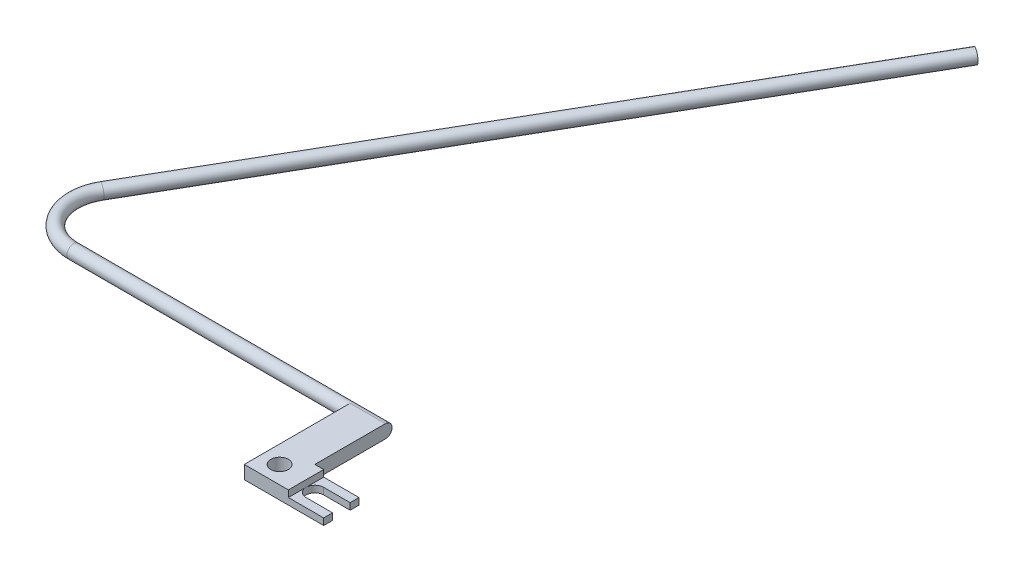
ISO-10303-21;
HEADER;
FILE_DESCRIPTION(('STEP AP214'),'2;1');
FILE_NAME('part.step','',(''),(''),'','','');
FILE_SCHEMA(('AUTOMOTIVE_DESIGN { 1 0 10303 214 1 1 1 1 }'));
ENDSEC;
DATA;
#1=APPLICATION_CONTEXT('core data for automotive mechanical design processes');
#2=APPLICATION_PROTOCOL_DEFINITION('international standard','automotive_design',2000,#1);
#3=PRODUCT_CONTEXT('',#1,'mechanical');
#4=PRODUCT('Part','Part','',(#3));
#5=PRODUCT_RELATED_PRODUCT_CATEGORY('part','',(#4));
#6=PRODUCT_DEFINITION_FORMATION('','',#4);
#7=PRODUCT_DEFINITION_CONTEXT('part definition',#1,'design');
#8=PRODUCT_DEFINITION('design','',#6,#7);
#9=PRODUCT_DEFINITION_SHAPE('','',#8);
#10=(LENGTH_UNIT() NAMED_UNIT(*) SI_UNIT(.MILLI.,.METRE.));
#11=(NAMED_UNIT(*) PLANE_ANGLE_UNIT() SI_UNIT($,.RADIAN.));
#12=(NAMED_UNIT(*) SI_UNIT($,.STERADIAN.) SOLID_ANGLE_UNIT());
#13=UNCERTAINTY_MEASURE_WITH_UNIT(LENGTH_MEASURE(1.E-05),#10,'distance_accuracy_value','');
#14=(GEOMETRIC_REPRESENTATION_CONTEXT(3) GLOBAL_UNCERTAINTY_ASSIGNED_CONTEXT((#13)) GLOBAL_UNIT_ASSIGNED_CONTEXT((#10,
#11,#12)) REPRESENTATION_CONTEXT('',''));
#15=CARTESIAN_POINT('',(0.,0.,0.));
#16=DIRECTION('',(0.,0.,1.));
#17=DIRECTION('',(1.,0.,0.));
#18=AXIS2_PLACEMENT_3D('',#15,#16,#17);
#19=CARTESIAN_POINT('',(3.99999999999999,3.,4.));
#20=DIRECTION('',(0.,1.,0.));
#21=DIRECTION('',(0.,0.,1.));
#22=AXIS2_PLACEMENT_3D('',#19,#20,#21);
#23=PLANE('',#22);
#24=DIRECTION('',(-1.,0.,0.));
#25=VECTOR('',#24,1.);
#26=CARTESIAN_POINT('',(2.,3.,-15.9963911959244));
#27=LINE('',#26,#25);
#28=CARTESIAN_POINT('',(0.,3.,-15.9963911959244));
#29=VERTEX_POINT('',#28);
#30=CARTESIAN_POINT('',(-8.,3.,-15.9963911959244));
#31=VERTEX_POINT('',#30);
#32=EDGE_CURVE('E127',#29,#31,#27,.T.);
#33=ORIENTED_EDGE('',*,*,#32,.T.);
#34=DIRECTION('',(0.,0.,1.));
#35=VECTOR('',#34,1.);
#36=CARTESIAN_POINT('',(-8.,3.,-20.));
#37=LINE('',#36,#35);
#38=CARTESIAN_POINT('',(-7.99999999999999,3.,8.));
#39=VERTEX_POINT('',#38);
#40=EDGE_CURVE('E131',#31,#39,#37,.T.);
#41=ORIENTED_EDGE('',*,*,#40,.T.);
#42=DIRECTION('',(1.,0.,0.));
#43=VECTOR('',#42,1.);
#44=CARTESIAN_POINT('',(-7.99999999999999,3.,8.));
#45=LINE('',#44,#43);
#46=CARTESIAN_POINT('',(2.,3.,8.));
#47=VERTEX_POINT('',#46);
#48=EDGE_CURVE('E141',#39,#47,#45,.T.);
#49=ORIENTED_EDGE('',*,*,#48,.T.);
#50=DIRECTION('',(0.,0.,-1.));
#51=VECTOR('',#50,1.);
#52=CARTESIAN_POINT('',(2.,3.,10.));
#53=LINE('',#52,#51);
#54=CARTESIAN_POINT('',(2.,3.,0.));
#55=VERTEX_POINT('',#54);
#56=EDGE_CURVE('E241',#47,#55,#53,.T.);
#57=ORIENTED_EDGE('',*,*,#56,.T.);
#58=DIRECTION('',(-1.,0.,0.));
#59=VECTOR('',#58,1.);
#60=CARTESIAN_POINT('',(10.,3.,0.));
#61=LINE('',#60,#59);
#62=CARTESIAN_POINT('',(0.,3.,0.));
#63=VERTEX_POINT('',#62);
#64=EDGE_CURVE('E168',#55,#63,#61,.T.);
#65=ORIENTED_EDGE('',*,*,#64,.T.);
#66=DIRECTION('',(0.,0.,-1.));
#67=VECTOR('',#66,1.);
#68=CARTESIAN_POINT('',(0.,3.,0.));
#69=LINE('',#68,#67);
#70=EDGE_CURVE('E134',#63,#29,#69,.T.);
#71=ORIENTED_EDGE('',*,*,#70,.T.);
#72=EDGE_LOOP('',(#33,#41,#49,#57,#65,#71));
#73=FACE_BOUND('',#72,.T.);
#74=CARTESIAN_POINT('',(-4.,3.,4.));
#75=DIRECTION('',(0.,1.,0.));
#76=DIRECTION('',(0.,0.,1.));
#77=AXIS2_PLACEMENT_3D('',#74,#75,#76);
#78=CIRCLE('',#77,2.);
#79=CARTESIAN_POINT('',(-4.,3.,6.));
#80=VERTEX_POINT('',#79);
#81=EDGE_CURVE('E161',#80,#80,#78,.T.);
#82=ORIENTED_EDGE('',*,*,#81,.F.);
#83=EDGE_LOOP('',(#82));
#84=FACE_BOUND('',#83,.T.);
#85=ADVANCED_FACE('F34',(#73,#84),#23,.T.);
#86=CARTESIAN_POINT('',(3.99999999999999,0.,4.));
#87=DIRECTION('',(0.,1.,0.));
#88=DIRECTION('',(0.,0.,1.));
#89=AXIS2_PLACEMENT_3D('',#86,#87,#88);
#90=PLANE('',#89);
#91=DIRECTION('',(0.,0.,1.));
#92=VECTOR('',#91,1.);
#93=CARTESIAN_POINT('',(-8.,0.,-20.));
#94=LINE('',#93,#92);
#95=CARTESIAN_POINT('',(-8.,0.,-15.9963911959244));
#96=VERTEX_POINT('',#95);
#97=CARTESIAN_POINT('',(-7.99999999999999,0.,8.));
#98=VERTEX_POINT('',#97);
#99=EDGE_CURVE('E164',#96,#98,#94,.T.);
#100=ORIENTED_EDGE('',*,*,#99,.F.);
#101=DIRECTION('',(-1.,0.,0.));
#102=VECTOR('',#101,1.);
#103=CARTESIAN_POINT('',(2.,0.,-15.9963911959244));
#104=LINE('',#103,#102);
#105=CARTESIAN_POINT('',(0.,0.,-15.9963911959244));
#106=VERTEX_POINT('',#105);
#107=EDGE_CURVE('E57',#106,#96,#104,.T.);
#108=ORIENTED_EDGE('',*,*,#107,.F.);
#109=DIRECTION('',(0.,0.,-1.));
#110=VECTOR('',#109,1.);
#111=CARTESIAN_POINT('',(0.,0.,0.));
#112=LINE('',#111,#110);
#113=CARTESIAN_POINT('',(0.,0.,0.));
#114=VERTEX_POINT('',#113);
#115=EDGE_CURVE('E142',#114,#106,#112,.T.);
#116=ORIENTED_EDGE('',*,*,#115,.F.);
#117=DIRECTION('',(-1.,0.,0.));
#118=VECTOR('',#117,1.);
#119=CARTESIAN_POINT('',(10.,0.,0.));
#120=LINE('',#119,#118);
#121=CARTESIAN_POINT('',(10.,0.,0.));
#122=VERTEX_POINT('',#121);
#123=EDGE_CURVE('E191',#122,#114,#120,.T.);
#124=ORIENTED_EDGE('',*,*,#123,.F.);
#125=DIRECTION('',(0.,0.,-1.));
#126=VECTOR('',#125,1.);
#127=CARTESIAN_POINT('',(10.,0.,2.));
#128=LINE('',#127,#126);
#129=CARTESIAN_POINT('',(10.,0.,2.));
#130=VERTEX_POINT('',#129);
#131=EDGE_CURVE('E188',#130,#122,#128,.T.);
#132=ORIENTED_EDGE('',*,*,#131,.F.);
#133=DIRECTION('',(1.,0.,0.));
#134=VECTOR('',#133,1.);
#135=CARTESIAN_POINT('',(3.99999999999999,0.,2.));
#136=LINE('',#135,#134);
#137=CARTESIAN_POINT('',(3.99999999999999,0.,2.));
#138=VERTEX_POINT('',#137);
#139=EDGE_CURVE('E185',#138,#130,#136,.T.);
#140=ORIENTED_EDGE('',*,*,#139,.F.);
#141=CARTESIAN_POINT('',(3.99999999999999,0.,4.));
#142=DIRECTION('',(0.,-1.,0.));
#143=DIRECTION('',(0.,0.,1.));
#144=AXIS2_PLACEMENT_3D('',#141,#142,#143);
#145=CIRCLE('',#144,2.);
#146=CARTESIAN_POINT('',(3.99999999999999,0.,6.));
#147=VERTEX_POINT('',#146);
#148=EDGE_CURVE('E182',#147,#138,#145,.T.);
#149=ORIENTED_EDGE('',*,*,#148,.F.);
#150=DIRECTION('',(-1.,0.,0.));
#151=VECTOR('',#150,1.);
#152=CARTESIAN_POINT('',(3.99999999999999,0.,6.));
#153=LINE('',#152,#151);
#154=CARTESIAN_POINT('',(10.,0.,6.));
#155=VERTEX_POINT('',#154);
#156=EDGE_CURVE('E179',#155,#147,#153,.T.);
#157=ORIENTED_EDGE('',*,*,#156,.F.);
#158=DIRECTION('',(0.,0.,-1.));
#159=VECTOR('',#158,1.);
#160=CARTESIAN_POINT('',(10.,0.,7.99999999999999));
#161=LINE('',#160,#159);
#162=CARTESIAN_POINT('',(10.,0.,7.99999999999999));
#163=VERTEX_POINT('',#162);
#164=EDGE_CURVE('E176',#163,#155,#161,.T.);
#165=ORIENTED_EDGE('',*,*,#164,.F.);
#166=DIRECTION('',(1.,0.,0.));
#167=VECTOR('',#166,1.);
#168=CARTESIAN_POINT('',(-7.99999999999999,0.,8.));
#169=LINE('',#168,#167);
#170=EDGE_CURVE('E173',#98,#163,#169,.T.);
#171=ORIENTED_EDGE('',*,*,#170,.F.);
#172=EDGE_LOOP('',(#100,#108,#116,#124,#132,#140,#149,#157,#165,#171));
#173=FACE_BOUND('',#172,.T.);
#174=CARTESIAN_POINT('',(-4.,0.,4.));
#175=DIRECTION('',(0.,1.,0.));
#176=DIRECTION('',(0.,0.,1.));
#177=AXIS2_PLACEMENT_3D('',#174,#175,#176);
#178=CIRCLE('',#177,2.);
#179=CARTESIAN_POINT('',(-4.,0.,6.));
#180=VERTEX_POINT('',#179);
#181=EDGE_CURVE('E160',#180,#180,#178,.T.);
#182=ORIENTED_EDGE('',*,*,#181,.T.);
#183=EDGE_LOOP('',(#182));
#184=FACE_BOUND('',#183,.T.);
#185=ADVANCED_FACE('F220',(#173,#184),#90,.F.);
#186=CARTESIAN_POINT('',(-8.,3.,-20.));
#187=DIRECTION('',(1.,0.,0.));
#188=DIRECTION('',(0.,0.,-1.));
#189=AXIS2_PLACEMENT_3D('',#186,#187,#188);
#190=PLANE('',#189);
#191=CARTESIAN_POINT('',(-8.,1.5,-15.9963911959244));
#192=DIRECTION('',(-1.,0.,0.));
#193=DIRECTION('',(0.,0.,1.));
#194=AXIS2_PLACEMENT_3D('',#191,#192,#193);
#195=CIRCLE('',#194,1.5);
#196=EDGE_CURVE('E42',#96,#31,#195,.T.);
#197=ORIENTED_EDGE('',*,*,#196,.F.);
#198=ORIENTED_EDGE('',*,*,#99,.T.);
#199=DIRECTION('',(0.,-1.,0.));
#200=VECTOR('',#199,1.);
#201=CARTESIAN_POINT('',(-7.99999999999999,3.,8.));
#202=LINE('',#201,#200);
#203=EDGE_CURVE('E139',#39,#98,#202,.T.);
#204=ORIENTED_EDGE('',*,*,#203,.F.);
#205=ORIENTED_EDGE('',*,*,#40,.F.);
#206=EDGE_LOOP('',(#197,#198,#204,#205));
#207=FACE_BOUND('',#206,.T.);
#208=ADVANCED_FACE('F36',(#207),#190,.F.);
#209=CARTESIAN_POINT('',(-7.99999999999999,3.,8.));
#210=DIRECTION('',(0.,0.,-1.));
#211=DIRECTION('',(-1.,0.,0.));
#212=AXIS2_PLACEMENT_3D('',#209,#210,#211);
#213=PLANE('',#212);
#214=DIRECTION('',(-1.,0.,0.));
#215=VECTOR('',#214,1.);
#216=CARTESIAN_POINT('',(-7.99999999999999,1.5,8.));
#217=LINE('',#216,#215);
#218=CARTESIAN_POINT('',(10.,1.5,7.99999999999999));
#219=VERTEX_POINT('',#218);
#220=CARTESIAN_POINT('',(2.,1.5,8.));
#221=VERTEX_POINT('',#220);
#222=EDGE_CURVE('E231',#219,#221,#217,.T.);
#223=ORIENTED_EDGE('',*,*,#222,.T.);
#224=DIRECTION('',(0.,1.,0.));
#225=VECTOR('',#224,1.);
#226=CARTESIAN_POINT('',(2.,3.,8.));
#227=LINE('',#226,#225);
#228=EDGE_CURVE('E149',#221,#47,#227,.T.);
#229=ORIENTED_EDGE('',*,*,#228,.T.);
#230=ORIENTED_EDGE('',*,*,#48,.F.);
#231=ORIENTED_EDGE('',*,*,#203,.T.);
#232=ORIENTED_EDGE('',*,*,#170,.T.);
#233=DIRECTION('',(0.,-1.,0.));
#234=VECTOR('',#233,1.);
#235=CARTESIAN_POINT('',(10.,3.,7.99999999999999));
#236=LINE('',#235,#234);
#237=EDGE_CURVE('E146',#219,#163,#236,.T.);
#238=ORIENTED_EDGE('',*,*,#237,.F.);
#239=EDGE_LOOP('',(#223,#229,#230,#231,#232,#238));
#240=FACE_BOUND('',#239,.T.);
#241=ADVANCED_FACE('F218',(#240),#213,.F.);
#242=CARTESIAN_POINT('',(10.,3.,7.99999999999999));
#243=DIRECTION('',(-1.,0.,0.));
#244=DIRECTION('',(0.,0.,1.));
#245=AXIS2_PLACEMENT_3D('',#242,#243,#244);
#246=PLANE('',#245);
#247=DIRECTION('',(0.,-1.,0.));
#248=VECTOR('',#247,1.);
#249=CARTESIAN_POINT('',(10.,3.,6.));
#250=LINE('',#249,#248);
#251=CARTESIAN_POINT('',(10.,1.5,6.));
#252=VERTEX_POINT('',#251);
#253=EDGE_CURVE('E205',#252,#155,#250,.T.);
#254=ORIENTED_EDGE('',*,*,#253,.F.);
#255=DIRECTION('',(0.,0.,-1.));
#256=VECTOR('',#255,1.);
#257=CARTESIAN_POINT('',(10.,1.5,10.));
#258=LINE('',#257,#256);
#259=EDGE_CURVE('E214',#219,#252,#258,.T.);
#260=ORIENTED_EDGE('',*,*,#259,.F.);
#261=ORIENTED_EDGE('',*,*,#237,.T.);
#262=ORIENTED_EDGE('',*,*,#164,.T.);
#263=EDGE_LOOP('',(#254,#260,#261,#262));
#264=FACE_BOUND('',#263,.T.);
#265=ADVANCED_FACE('F211',(#264),#246,.F.);
#266=CARTESIAN_POINT('',(3.99999999999999,3.,6.));
#267=DIRECTION('',(0.,0.,1.));
#268=DIRECTION('',(1.,0.,0.));
#269=AXIS2_PLACEMENT_3D('',#266,#267,#268);
#270=PLANE('',#269);
#271=DIRECTION('',(0.,-1.,0.));
#272=VECTOR('',#271,1.);
#273=CARTESIAN_POINT('',(3.99999999999999,3.,6.));
#274=LINE('',#273,#272);
#275=CARTESIAN_POINT('',(3.99999999999999,1.5,6.));
#276=VERTEX_POINT('',#275);
#277=EDGE_CURVE('E203',#276,#147,#274,.T.);
#278=ORIENTED_EDGE('',*,*,#277,.F.);
#279=DIRECTION('',(1.,0.,0.));
#280=VECTOR('',#279,1.);
#281=CARTESIAN_POINT('',(3.99999999999999,1.5,6.));
#282=LINE('',#281,#280);
#283=EDGE_CURVE('E228',#276,#252,#282,.T.);
#284=ORIENTED_EDGE('',*,*,#283,.T.);
#285=ORIENTED_EDGE('',*,*,#253,.T.);
#286=ORIENTED_EDGE('',*,*,#156,.T.);
#287=EDGE_LOOP('',(#278,#284,#285,#286));
#288=FACE_BOUND('',#287,.T.);
#289=ADVANCED_FACE('F226',(#288),#270,.F.);
#290=CARTESIAN_POINT('',(3.99999999999999,3.,4.));
#291=DIRECTION('',(0.,-1.,0.));
#292=DIRECTION('',(0.,0.,-1.));
#293=AXIS2_PLACEMENT_3D('',#290,#291,#292);
#294=CYLINDRICAL_SURFACE('',#293,2.);
#295=CARTESIAN_POINT('',(3.99999999999999,1.5,4.));
#296=DIRECTION('',(0.,-1.,0.));
#297=DIRECTION('',(0.,0.,-1.));
#298=AXIS2_PLACEMENT_3D('',#295,#296,#297);
#299=CIRCLE('',#298,2.);
#300=CARTESIAN_POINT('',(3.99999999999999,1.5,2.));
#301=VERTEX_POINT('',#300);
#302=CARTESIAN_POINT('',(2.,1.5,4.));
#303=VERTEX_POINT('',#302);
#304=EDGE_CURVE('E234',#301,#303,#299,.F.);
#305=ORIENTED_EDGE('',*,*,#304,.T.);
#306=EDGE_CURVE('E232',#303,#276,#299,.F.);
#307=ORIENTED_EDGE('',*,*,#306,.T.);
#308=ORIENTED_EDGE('',*,*,#277,.T.);
#309=ORIENTED_EDGE('',*,*,#148,.T.);
#310=DIRECTION('',(0.,-1.,0.));
#311=VECTOR('',#310,1.);
#312=CARTESIAN_POINT('',(3.99999999999999,3.,2.));
#313=LINE('',#312,#311);
#314=EDGE_CURVE('E201',#301,#138,#313,.T.);
#315=ORIENTED_EDGE('',*,*,#314,.F.);
#316=EDGE_LOOP('',(#305,#307,#308,#309,#315));
#317=FACE_BOUND('',#316,.T.);
#318=ADVANCED_FACE('F267',(#317),#294,.F.);
#319=CARTESIAN_POINT('',(3.99999999999999,3.,2.));
#320=DIRECTION('',(0.,0.,-1.));
#321=DIRECTION('',(-1.,0.,0.));
#322=AXIS2_PLACEMENT_3D('',#319,#320,#321);
#323=PLANE('',#322);
#324=DIRECTION('',(0.,-1.,0.));
#325=VECTOR('',#324,1.);
#326=CARTESIAN_POINT('',(10.,3.,2.));
#327=LINE('',#326,#325);
#328=CARTESIAN_POINT('',(10.,1.5,2.));
#329=VERTEX_POINT('',#328);
#330=EDGE_CURVE('E199',#329,#130,#327,.T.);
#331=ORIENTED_EDGE('',*,*,#330,.F.);
#332=DIRECTION('',(-1.,0.,0.));
#333=VECTOR('',#332,1.);
#334=CARTESIAN_POINT('',(3.99999999999999,1.5,2.));
#335=LINE('',#334,#333);
#336=EDGE_CURVE('E238',#329,#301,#335,.T.);
#337=ORIENTED_EDGE('',*,*,#336,.T.);
#338=ORIENTED_EDGE('',*,*,#314,.T.);
#339=ORIENTED_EDGE('',*,*,#139,.T.);
#340=EDGE_LOOP('',(#331,#337,#338,#339));
#341=FACE_BOUND('',#340,.T.);
#342=ADVANCED_FACE('F270',(#341),#323,.F.);
#343=CARTESIAN_POINT('',(10.,3.,2.));
#344=DIRECTION('',(-1.,0.,0.));
#345=DIRECTION('',(0.,0.,1.));
#346=AXIS2_PLACEMENT_3D('',#343,#344,#345);
#347=PLANE('',#346);
#348=DIRECTION('',(0.,-1.,0.));
#349=VECTOR('',#348,1.);
#350=CARTESIAN_POINT('',(10.,3.,0.));
#351=LINE('',#350,#349);
#352=CARTESIAN_POINT('',(10.,1.5,0.));
#353=VERTEX_POINT('',#352);
#354=EDGE_CURVE('E197',#353,#122,#351,.T.);
#355=ORIENTED_EDGE('',*,*,#354,.F.);
#356=EDGE_CURVE('E49',#329,#353,#258,.T.);
#357=ORIENTED_EDGE('',*,*,#356,.F.);
#358=ORIENTED_EDGE('',*,*,#330,.T.);
#359=ORIENTED_EDGE('',*,*,#131,.T.);
#360=EDGE_LOOP('',(#355,#357,#358,#359));
#361=FACE_BOUND('',#360,.T.);
#362=ADVANCED_FACE('F273',(#361),#347,.F.);
#363=CARTESIAN_POINT('',(10.,3.,0.));
#364=DIRECTION('',(0.,0.,1.));
#365=DIRECTION('',(1.,0.,0.));
#366=AXIS2_PLACEMENT_3D('',#363,#364,#365);
#367=PLANE('',#366);
#368=ORIENTED_EDGE('',*,*,#64,.F.);
#369=DIRECTION('',(0.,1.,0.));
#370=VECTOR('',#369,1.);
#371=CARTESIAN_POINT('',(2.,3.,0.));
#372=LINE('',#371,#370);
#373=CARTESIAN_POINT('',(2.,1.5,0.));
#374=VERTEX_POINT('',#373);
#375=EDGE_CURVE('E243',#374,#55,#372,.T.);
#376=ORIENTED_EDGE('',*,*,#375,.F.);
#377=DIRECTION('',(-1.,0.,0.));
#378=VECTOR('',#377,1.);
#379=CARTESIAN_POINT('',(10.,1.5,0.));
#380=LINE('',#379,#378);
#381=EDGE_CURVE('E250',#353,#374,#380,.T.);
#382=ORIENTED_EDGE('',*,*,#381,.F.);
#383=ORIENTED_EDGE('',*,*,#354,.T.);
#384=ORIENTED_EDGE('',*,*,#123,.T.);
#385=DIRECTION('',(0.,-1.,0.));
#386=VECTOR('',#385,1.);
#387=CARTESIAN_POINT('',(0.,3.,0.));
#388=LINE('',#387,#386);
#389=EDGE_CURVE('E171',#63,#114,#388,.T.);
#390=ORIENTED_EDGE('',*,*,#389,.F.);
#391=EDGE_LOOP('',(#368,#376,#382,#383,#384,#390));
#392=FACE_BOUND('',#391,.T.);
#393=ADVANCED_FACE('F259',(#392),#367,.F.);
#394=CARTESIAN_POINT('',(0.,3.,0.));
#395=DIRECTION('',(-1.,0.,0.));
#396=DIRECTION('',(0.,0.,1.));
#397=AXIS2_PLACEMENT_3D('',#394,#395,#396);
#398=PLANE('',#397);
#399=ORIENTED_EDGE('',*,*,#115,.T.);
#400=CARTESIAN_POINT('',(0.,1.5,-15.9963911959244));
#401=DIRECTION('',(-1.,0.,0.));
#402=DIRECTION('',(0.,0.,1.));
#403=AXIS2_PLACEMENT_3D('',#400,#401,#402);
#404=CIRCLE('',#403,1.5);
#405=EDGE_CURVE('E11',#106,#29,#404,.F.);
#406=ORIENTED_EDGE('',*,*,#405,.T.);
#407=ORIENTED_EDGE('',*,*,#70,.F.);
#408=ORIENTED_EDGE('',*,*,#389,.T.);
#409=EDGE_LOOP('',(#399,#406,#407,#408));
#410=FACE_BOUND('',#409,.T.);
#411=ADVANCED_FACE('F277',(#410),#398,.F.);
#412=CARTESIAN_POINT('',(-4.,3.,4.));
#413=DIRECTION('',(0.,-1.,0.));
#414=DIRECTION('',(0.,0.,-1.));
#415=AXIS2_PLACEMENT_3D('',#412,#413,#414);
#416=CYLINDRICAL_SURFACE('',#415,2.);
#417=ORIENTED_EDGE('',*,*,#81,.T.);
#418=EDGE_LOOP('',(#417));
#419=FACE_BOUND('',#418,.T.);
#420=ORIENTED_EDGE('',*,*,#181,.F.);
#421=EDGE_LOOP('',(#420));
#422=FACE_BOUND('',#421,.T.);
#423=ADVANCED_FACE('F279',(#419,#422),#416,.F.);
#424=CARTESIAN_POINT('',(-6.8428712781617,1.5,-156.575487950781));
#425=DIRECTION('',(0.500000000000004,0.,-0.866025403784436));
#426=DIRECTION('',(-0.866025403784436,0.,-0.500000000000004));
#427=AXIS2_PLACEMENT_3D('',#424,#425,#426);
#428=PLANE('',#427);
#429=CARTESIAN_POINT('',(-6.8428712781617,1.5,-156.575487950781));
#430=DIRECTION('',(0.500000000000004,0.,-0.866025403784436));
#431=DIRECTION('',(-0.866025403784436,0.,-0.500000000000004));
#432=AXIS2_PLACEMENT_3D('',#429,#430,#431);
#433=CIRCLE('',#432,1.5);
#434=CARTESIAN_POINT('',(-8.14190938383835,1.5,-157.325487950781));
#435=VERTEX_POINT('',#434);
#436=EDGE_CURVE('E157',#435,#435,#433,.T.);
#437=ORIENTED_EDGE('',*,*,#436,.T.);
#438=EDGE_LOOP('',(#437));
#439=FACE_BOUND('',#438,.T.);
#440=ADVANCED_FACE('F285',(#439),#428,.T.);
#441=CARTESIAN_POINT('',(-8.,1.5,-15.9963911959244));
#442=DIRECTION('',(-1.,0.,0.));
#443=DIRECTION('',(0.,0.,1.));
#444=AXIS2_PLACEMENT_3D('',#441,#442,#443);
#445=CYLINDRICAL_SURFACE('',#444,1.5);
#446=CARTESIAN_POINT('',(-70.6794919243111,1.5,-15.9963911959244));
#447=DIRECTION('',(-1.,0.,0.));
#448=DIRECTION('',(0.,0.,1.));
#449=AXIS2_PLACEMENT_3D('',#446,#447,#448);
#450=CIRCLE('',#449,1.5);
#451=CARTESIAN_POINT('',(-70.6794919243111,1.5,-14.4963911959244));
#452=VERTEX_POINT('',#451);
#453=EDGE_CURVE('E151',#452,#452,#450,.T.);
#454=ORIENTED_EDGE('',*,*,#453,.F.);
#455=EDGE_LOOP('',(#454));
#456=FACE_BOUND('',#455,.T.);
#457=ORIENTED_EDGE('',*,*,#196,.T.);
#458=ORIENTED_EDGE('',*,*,#32,.F.);
#459=ORIENTED_EDGE('',*,*,#405,.F.);
#460=ORIENTED_EDGE('',*,*,#107,.T.);
#461=EDGE_LOOP('',(#457,#458,#459,#460));
#462=FACE_BOUND('',#461,.T.);
#463=ADVANCED_FACE('F144',(#456,#462),#445,.T.);
#464=CARTESIAN_POINT('',(-70.6794919243111,1.5,-26.));
#465=DIRECTION('',(0.,-1.,0.));
#466=DIRECTION('',(0.,0.,-1.));
#467=AXIS2_PLACEMENT_3D('',#464,#465,#466);
#468=TOROIDAL_SURFACE('',#467,10.0036088040756,1.5);
#469=CARTESIAN_POINT('',(-79.3428712781622,1.5,-31.0018044020378));
#470=DIRECTION('',(0.500000000000003,0.,-0.866025403784437));
#471=DIRECTION('',(-0.866025403784437,0.,-0.500000000000003));
#472=AXIS2_PLACEMENT_3D('',#469,#470,#471);
#473=CIRCLE('',#472,1.5);
#474=CARTESIAN_POINT('',(-80.6419093838389,1.5,-31.7518044020378));
#475=VERTEX_POINT('',#474);
#476=EDGE_CURVE('E154',#475,#475,#473,.T.);
#477=CARTESIAN_POINT('',(-70.6794919243111,1.5,-26.));
#478=DIRECTION('',(0.,-1.,0.));
#479=DIRECTION('',(0.,0.,-1.));
#480=AXIS2_PLACEMENT_3D('',#477,#478,#479);
#481=CIRCLE('',#480,11.5036088040756);
#482=EDGE_CURVE('',#452,#475,#481,.T.);
#483=ORIENTED_EDGE('',*,*,#453,.T.);
#484=ORIENTED_EDGE('',*,*,#476,.F.);
#485=ORIENTED_EDGE('',*,*,#482,.T.);
#486=ORIENTED_EDGE('',*,*,#482,.F.);
#487=EDGE_LOOP('',(#483,#485,#484,#486));
#488=FACE_BOUND('',#487,.T.);
#489=ADVANCED_FACE('F302',(#488),#468,.T.);
#490=CARTESIAN_POINT('',(-79.3428712781622,1.5,-31.0018044020378));
#491=DIRECTION('',(0.500000000000004,0.,-0.866025403784437));
#492=DIRECTION('',(-0.866025403784436,0.,-0.500000000000004));
#493=AXIS2_PLACEMENT_3D('',#490,#491,#492);
#494=CYLINDRICAL_SURFACE('',#493,1.5);
#495=ORIENTED_EDGE('',*,*,#436,.F.);
#496=EDGE_LOOP('',(#495));
#497=FACE_BOUND('',#496,.T.);
#498=ORIENTED_EDGE('',*,*,#476,.T.);
#499=EDGE_LOOP('',(#498));
#500=FACE_BOUND('',#499,.T.);
#501=ADVANCED_FACE('F288',(#497,#500),#494,.T.);
#502=CARTESIAN_POINT('',(2.,3.,10.));
#503=DIRECTION('',(-1.,0.,0.));
#504=DIRECTION('',(0.,0.,1.));
#505=AXIS2_PLACEMENT_3D('',#502,#503,#504);
#506=PLANE('',#505);
#507=DIRECTION('',(0.,0.,-1.));
#508=VECTOR('',#507,1.);
#509=CARTESIAN_POINT('',(2.,1.5,10.));
#510=LINE('',#509,#508);
#511=EDGE_CURVE('E246',#221,#303,#510,.T.);
#512=ORIENTED_EDGE('',*,*,#511,.T.);
#513=EDGE_CURVE('E244',#303,#374,#510,.T.);
#514=ORIENTED_EDGE('',*,*,#513,.T.);
#515=ORIENTED_EDGE('',*,*,#375,.T.);
#516=ORIENTED_EDGE('',*,*,#56,.F.);
#517=ORIENTED_EDGE('',*,*,#228,.F.);
#518=EDGE_LOOP('',(#512,#514,#515,#516,#517));
#519=FACE_BOUND('',#518,.T.);
#520=ADVANCED_FACE('F262',(#519),#506,.F.);
#521=CARTESIAN_POINT('',(10.,1.5,10.));
#522=DIRECTION('',(0.,-1.,0.));
#523=DIRECTION('',(0.,0.,-1.));
#524=AXIS2_PLACEMENT_3D('',#521,#522,#523);
#525=PLANE('',#524);
#526=ORIENTED_EDGE('',*,*,#259,.T.);
#527=ORIENTED_EDGE('',*,*,#283,.F.);
#528=ORIENTED_EDGE('',*,*,#306,.F.);
#529=ORIENTED_EDGE('',*,*,#511,.F.);
#530=ORIENTED_EDGE('',*,*,#222,.F.);
#531=EDGE_LOOP('',(#526,#527,#528,#529,#530));
#532=FACE_BOUND('',#531,.T.);
#533=ADVANCED_FACE('F310',(#532),#525,.F.);
#534=ORIENTED_EDGE('',*,*,#336,.F.);
#535=ORIENTED_EDGE('',*,*,#356,.T.);
#536=ORIENTED_EDGE('',*,*,#381,.T.);
#537=ORIENTED_EDGE('',*,*,#513,.F.);
#538=ORIENTED_EDGE('',*,*,#304,.F.);
#539=EDGE_LOOP('',(#534,#535,#536,#537,#538));
#540=FACE_BOUND('',#539,.T.);
#541=ADVANCED_FACE('F254',(#540),#525,.F.);
#542=CLOSED_SHELL('',(#85,#185,#208,#241,#265,#289,#318,#342,#362,#393,#411,#423,#440,#463,#489,
#501,#520,#533,#541));
#543=MANIFOLD_SOLID_BREP('B2',#542);
#544=ADVANCED_BREP_SHAPE_REPRESENTATION('',(#18,#543),#14);
#545=SHAPE_DEFINITION_REPRESENTATION(#9,#544);
ENDSEC;
END-ISO-10303-21;
